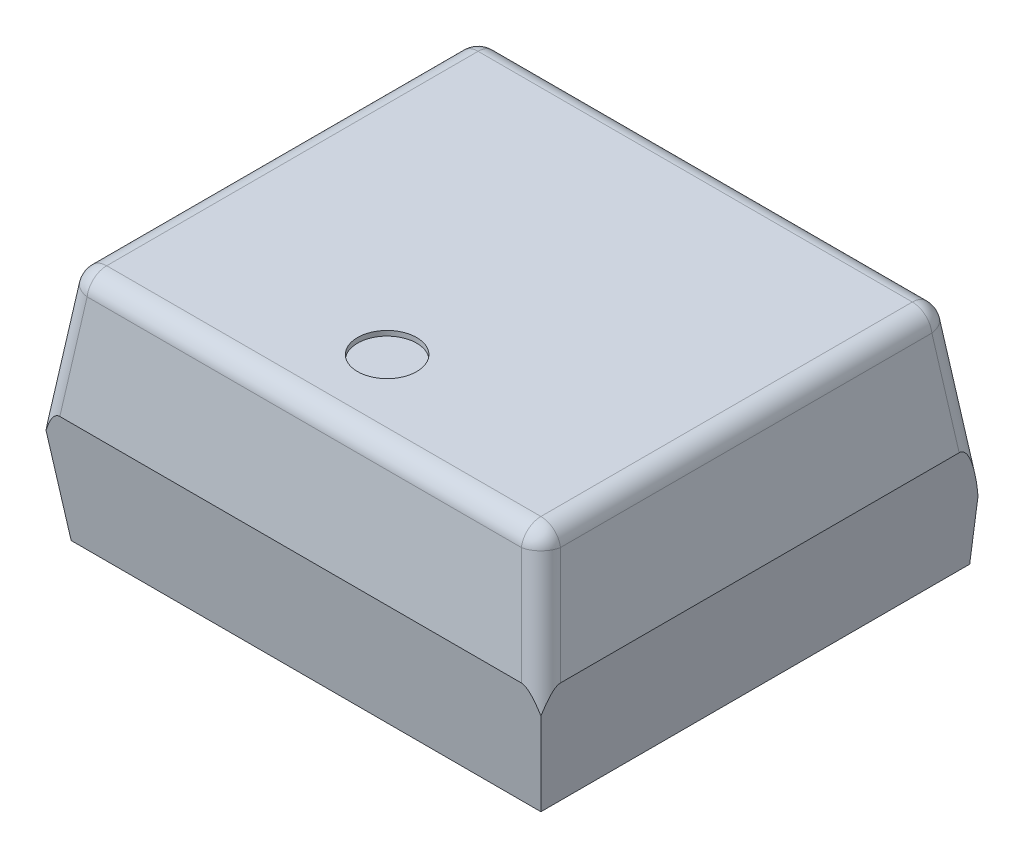
ISO-10303-21;
HEADER;
FILE_DESCRIPTION(('STEP AP214'),'2;1');
FILE_NAME('part.step','',(''),(''),'','','');
FILE_SCHEMA(('AUTOMOTIVE_DESIGN { 1 0 10303 214 1 1 1 1 }'));
ENDSEC;
DATA;
#1=APPLICATION_CONTEXT('core data for automotive mechanical design processes');
#2=APPLICATION_PROTOCOL_DEFINITION('international standard','automotive_design',2000,#1);
#3=PRODUCT_CONTEXT('',#1,'mechanical');
#4=PRODUCT('Part','Part','',(#3));
#5=PRODUCT_RELATED_PRODUCT_CATEGORY('part','',(#4));
#6=PRODUCT_DEFINITION_FORMATION('','',#4);
#7=PRODUCT_DEFINITION_CONTEXT('part definition',#1,'design');
#8=PRODUCT_DEFINITION('design','',#6,#7);
#9=PRODUCT_DEFINITION_SHAPE('','',#8);
#10=(LENGTH_UNIT() NAMED_UNIT(*) SI_UNIT(.MILLI.,.METRE.));
#11=(NAMED_UNIT(*) PLANE_ANGLE_UNIT() SI_UNIT($,.RADIAN.));
#12=(NAMED_UNIT(*) SI_UNIT($,.STERADIAN.) SOLID_ANGLE_UNIT());
#13=UNCERTAINTY_MEASURE_WITH_UNIT(LENGTH_MEASURE(1.E-05),#10,'distance_accuracy_value','');
#14=(GEOMETRIC_REPRESENTATION_CONTEXT(3) GLOBAL_UNCERTAINTY_ASSIGNED_CONTEXT((#13)) GLOBAL_UNIT_ASSIGNED_CONTEXT((#10,
#11,#12)) REPRESENTATION_CONTEXT('',''));
#15=CARTESIAN_POINT('',(0.,0.,0.));
#16=DIRECTION('',(0.,0.,1.));
#17=DIRECTION('',(1.,0.,0.));
#18=AXIS2_PLACEMENT_3D('',#15,#16,#17);
#19=CARTESIAN_POINT('',(-4.406529143216,2.051,0.));
#20=DIRECTION('',(0.,0.,1.));
#21=DIRECTION('',(-0.659345815100019,0.751839807479021,0.));
#22=AXIS2_PLACEMENT_3D('',#19,#20,#21);
#23=CYLINDRICAL_SURFACE('',#22,0.4);
#24=CARTESIAN_POINT('',(-4.406529143216,2.051,-3.834029143216));
#25=DIRECTION('',(0.,0.,1.));
#26=DIRECTION('',(0.,1.,0.));
#27=AXIS2_PLACEMENT_3D('',#24,#25,#26);
#28=CIRCLE('',#27,0.4);
#29=CARTESIAN_POINT('',(-4.406529143216,2.451,-3.834029143216));
#30=VERTEX_POINT('',#29);
#31=CARTESIAN_POINT('',(-4.803107087766,2.103210476888,-3.834029143216));
#32=VERTEX_POINT('',#31);
#33=EDGE_CURVE('E11',#30,#32,#28,.T.);
#34=ORIENTED_EDGE('',*,*,#33,.T.);
#35=DIRECTION('',(0.,0.,1.));
#36=VECTOR('',#35,1.);
#37=CARTESIAN_POINT('',(-4.803107087766,2.103210476888,0.));
#38=LINE('',#37,#36);
#39=CARTESIAN_POINT('',(-4.803107087766,2.103210476888,3.704029143216));
#40=VERTEX_POINT('',#39);
#41=EDGE_CURVE('E28',#32,#40,#38,.T.);
#42=ORIENTED_EDGE('',*,*,#41,.T.);
#43=CARTESIAN_POINT('',(-4.406529143216,2.051,3.704029143216));
#44=DIRECTION('',(0.,0.,-1.));
#45=DIRECTION('',(-0.99144486137382,0.130526192219976,0.));
#46=AXIS2_PLACEMENT_3D('',#43,#44,#45);
#47=CIRCLE('',#46,0.4);
#48=CARTESIAN_POINT('',(-4.406529143216,2.451,3.704029143216));
#49=VERTEX_POINT('',#48);
#50=EDGE_CURVE('E222',#40,#49,#47,.T.);
#51=ORIENTED_EDGE('',*,*,#50,.T.);
#52=DIRECTION('',(0.,0.,-1.));
#53=VECTOR('',#52,1.);
#54=CARTESIAN_POINT('',(-4.406529143216,2.451,0.));
#55=LINE('',#54,#53);
#56=EDGE_CURVE('E218',#49,#30,#55,.T.);
#57=ORIENTED_EDGE('',*,*,#56,.T.);
#58=EDGE_LOOP('',(#34,#42,#51,#57));
#59=FACE_BOUND('',#58,.T.);
#60=ADVANCED_FACE('F17',(#59),#23,.T.);
#61=CARTESIAN_POINT('',(-5.08,2.051,-3.834029143216));
#62=DIRECTION('',(-1.,0.,0.));
#63=DIRECTION('',(0.,0.751839807479021,-0.659345815100019));
#64=AXIS2_PLACEMENT_3D('',#61,#62,#63);
#65=CYLINDRICAL_SURFACE('',#64,0.4);
#66=CARTESIAN_POINT('',(4.406529143216,2.051,-3.834029143216));
#67=DIRECTION('',(-1.,0.,0.));
#68=DIRECTION('',(0.,1.,0.));
#69=AXIS2_PLACEMENT_3D('',#66,#67,#68);
#70=CIRCLE('',#69,0.4);
#71=CARTESIAN_POINT('',(4.406529143216,2.451,-3.834029143216));
#72=VERTEX_POINT('',#71);
#73=CARTESIAN_POINT('',(4.406529143216,2.103210476888,-4.230607087766));
#74=VERTEX_POINT('',#73);
#75=EDGE_CURVE('E223',#72,#74,#70,.T.);
#76=ORIENTED_EDGE('',*,*,#75,.T.);
#77=DIRECTION('',(-1.,0.,0.));
#78=VECTOR('',#77,1.);
#79=CARTESIAN_POINT('',(-5.08,2.103210476888,-4.230607087766));
#80=LINE('',#79,#78);
#81=CARTESIAN_POINT('',(-4.406529143216,2.103210476888,-4.230607087766));
#82=VERTEX_POINT('',#81);
#83=EDGE_CURVE('E252',#74,#82,#80,.T.);
#84=ORIENTED_EDGE('',*,*,#83,.T.);
#85=CARTESIAN_POINT('',(-4.406529143216,2.051,-3.834029143216));
#86=DIRECTION('',(1.,0.,0.));
#87=DIRECTION('',(0.,0.130526192219976,-0.99144486137382));
#88=AXIS2_PLACEMENT_3D('',#85,#86,#87);
#89=CIRCLE('',#88,0.4);
#90=EDGE_CURVE('E365',#82,#30,#89,.T.);
#91=ORIENTED_EDGE('',*,*,#90,.T.);
#92=DIRECTION('',(1.,0.,0.));
#93=VECTOR('',#92,1.);
#94=CARTESIAN_POINT('',(-5.08,2.451,-3.834029143216));
#95=LINE('',#94,#93);
#96=EDGE_CURVE('E300',#30,#72,#95,.T.);
#97=ORIENTED_EDGE('',*,*,#96,.T.);
#98=EDGE_LOOP('',(#76,#84,#91,#97));
#99=FACE_BOUND('',#98,.T.);
#100=ADVANCED_FACE('F489',(#99),#65,.T.);
#101=CARTESIAN_POINT('',(-4.406529143216,2.051,-3.834029143216));
#102=DIRECTION('',(0.,0.,1.));
#103=DIRECTION('',(1.,0.,0.));
#104=AXIS2_PLACEMENT_3D('',#101,#102,#103);
#105=SPHERICAL_SURFACE('',#104,0.4);
#106=ORIENTED_EDGE('',*,*,#90,.F.);
#107=CARTESIAN_POINT('',(-4.406529143216,2.051,-3.834029143216));
#108=DIRECTION('',(0.1294283079954,0.983105602760403,0.1294283079954));
#109=DIRECTION('',(-0.695160638334369,0.183039268522097,-0.695160638334369));
#110=AXIS2_PLACEMENT_3D('',#107,#108,#109);
#111=CIRCLE('',#110,0.4);
#112=EDGE_CURVE('E42',#82,#32,#111,.T.);
#113=ORIENTED_EDGE('',*,*,#112,.T.);
#114=ORIENTED_EDGE('',*,*,#33,.F.);
#115=EDGE_LOOP('',(#106,#113,#114));
#116=FACE_BOUND('',#115,.T.);
#117=ADVANCED_FACE('F495',(#116),#105,.T.);
#118=CARTESIAN_POINT('',(4.406529143216,2.051,0.));
#119=DIRECTION('',(0.,0.,-1.));
#120=DIRECTION('',(0.659345815100019,0.751839807479021,0.));
#121=AXIS2_PLACEMENT_3D('',#118,#119,#120);
#122=CYLINDRICAL_SURFACE('',#121,0.4);
#123=CARTESIAN_POINT('',(4.406529143216,2.051,3.704029143216));
#124=DIRECTION('',(0.,0.,-1.));
#125=DIRECTION('',(0.,1.,0.));
#126=AXIS2_PLACEMENT_3D('',#123,#124,#125);
#127=CIRCLE('',#126,0.4);
#128=CARTESIAN_POINT('',(4.406529143216,2.451,3.704029143216));
#129=VERTEX_POINT('',#128);
#130=CARTESIAN_POINT('',(4.803107087766,2.103210476888,3.704029143216));
#131=VERTEX_POINT('',#130);
#132=EDGE_CURVE('E301',#129,#131,#127,.T.);
#133=ORIENTED_EDGE('',*,*,#132,.T.);
#134=DIRECTION('',(0.,0.,-1.));
#135=VECTOR('',#134,1.);
#136=CARTESIAN_POINT('',(4.803107087766,2.103210476888,0.));
#137=LINE('',#136,#135);
#138=CARTESIAN_POINT('',(4.803107087766,2.103210476888,-3.834029143216));
#139=VERTEX_POINT('',#138);
#140=EDGE_CURVE('E274',#131,#139,#137,.T.);
#141=ORIENTED_EDGE('',*,*,#140,.T.);
#142=CARTESIAN_POINT('',(4.406529143216,2.051,-3.834029143216));
#143=DIRECTION('',(0.,0.,1.));
#144=DIRECTION('',(0.99144486137382,0.130526192219976,0.));
#145=AXIS2_PLACEMENT_3D('',#142,#143,#144);
#146=CIRCLE('',#145,0.4);
#147=EDGE_CURVE('E271',#139,#72,#146,.T.);
#148=ORIENTED_EDGE('',*,*,#147,.T.);
#149=DIRECTION('',(0.,0.,1.));
#150=VECTOR('',#149,1.);
#151=CARTESIAN_POINT('',(4.406529143216,2.451,0.));
#152=LINE('',#151,#150);
#153=EDGE_CURVE('E275',#72,#129,#152,.T.);
#154=ORIENTED_EDGE('',*,*,#153,.T.);
#155=EDGE_LOOP('',(#133,#141,#148,#154));
#156=FACE_BOUND('',#155,.T.);
#157=ADVANCED_FACE('F523',(#156),#122,.T.);
#158=CARTESIAN_POINT('',(4.406529143216,2.051,-3.834029143216));
#159=DIRECTION('',(0.,0.,1.));
#160=DIRECTION('',(1.,0.,0.));
#161=AXIS2_PLACEMENT_3D('',#158,#159,#160);
#162=SPHERICAL_SURFACE('',#161,0.4);
#163=ORIENTED_EDGE('',*,*,#147,.F.);
#164=CARTESIAN_POINT('',(4.406529143216,2.051,-3.834029143216));
#165=DIRECTION('',(-0.1294283079954,0.983105602760403,0.1294283079954));
#166=DIRECTION('',(0.695160638334369,0.183039268522097,-0.695160638334369));
#167=AXIS2_PLACEMENT_3D('',#164,#165,#166);
#168=CIRCLE('',#167,0.4);
#169=EDGE_CURVE('E21',#139,#74,#168,.T.);
#170=ORIENTED_EDGE('',*,*,#169,.T.);
#171=ORIENTED_EDGE('',*,*,#75,.F.);
#172=EDGE_LOOP('',(#163,#170,#171));
#173=FACE_BOUND('',#172,.T.);
#174=ADVANCED_FACE('F504',(#173),#162,.T.);
#175=CARTESIAN_POINT('',(-5.08,2.051,3.704029143216));
#176=DIRECTION('',(1.,0.,0.));
#177=DIRECTION('',(0.,0.751839807479021,0.659345815100019));
#178=AXIS2_PLACEMENT_3D('',#175,#176,#177);
#179=CYLINDRICAL_SURFACE('',#178,0.4);
#180=CARTESIAN_POINT('',(-4.406529143216,2.051,3.704029143216));
#181=DIRECTION('',(1.,0.,0.));
#182=DIRECTION('',(0.,1.,0.));
#183=AXIS2_PLACEMENT_3D('',#180,#181,#182);
#184=CIRCLE('',#183,0.4);
#185=CARTESIAN_POINT('',(-4.406529143216,2.103210476888,4.100607087766));
#186=VERTEX_POINT('',#185);
#187=EDGE_CURVE('E283',#49,#186,#184,.T.);
#188=ORIENTED_EDGE('',*,*,#187,.T.);
#189=DIRECTION('',(1.,0.,0.));
#190=VECTOR('',#189,1.);
#191=CARTESIAN_POINT('',(-5.08,2.103210476888,4.100607087766));
#192=LINE('',#191,#190);
#193=CARTESIAN_POINT('',(4.406529143216,2.103210476888,4.100607087766));
#194=VERTEX_POINT('',#193);
#195=EDGE_CURVE('E279',#186,#194,#192,.T.);
#196=ORIENTED_EDGE('',*,*,#195,.T.);
#197=CARTESIAN_POINT('',(4.406529143216,2.051,3.704029143216));
#198=DIRECTION('',(-1.,0.,0.));
#199=DIRECTION('',(0.,0.130526192219976,0.99144486137382));
#200=AXIS2_PLACEMENT_3D('',#197,#198,#199);
#201=CIRCLE('',#200,0.4);
#202=EDGE_CURVE('E206',#194,#129,#201,.T.);
#203=ORIENTED_EDGE('',*,*,#202,.T.);
#204=DIRECTION('',(-1.,0.,0.));
#205=VECTOR('',#204,1.);
#206=CARTESIAN_POINT('',(-5.08,2.451,3.704029143216));
#207=LINE('',#206,#205);
#208=EDGE_CURVE('E202',#129,#49,#207,.T.);
#209=ORIENTED_EDGE('',*,*,#208,.T.);
#210=EDGE_LOOP('',(#188,#196,#203,#209));
#211=FACE_BOUND('',#210,.T.);
#212=ADVANCED_FACE('F500',(#211),#179,.T.);
#213=CARTESIAN_POINT('',(4.406529143216,2.051,3.704029143216));
#214=DIRECTION('',(0.,0.,1.));
#215=DIRECTION('',(1.,0.,0.));
#216=AXIS2_PLACEMENT_3D('',#213,#214,#215);
#217=SPHERICAL_SURFACE('',#216,0.4);
#218=ORIENTED_EDGE('',*,*,#202,.F.);
#219=CARTESIAN_POINT('',(4.406529143216,2.051,3.704029143216));
#220=DIRECTION('',(-0.1294283079954,0.983105602760403,-0.1294283079954));
#221=DIRECTION('',(0.695160638334369,0.183039268522097,0.695160638334369));
#222=AXIS2_PLACEMENT_3D('',#219,#220,#221);
#223=CIRCLE('',#222,0.4);
#224=EDGE_CURVE('E207',#194,#131,#223,.T.);
#225=ORIENTED_EDGE('',*,*,#224,.T.);
#226=ORIENTED_EDGE('',*,*,#132,.F.);
#227=EDGE_LOOP('',(#218,#225,#226));
#228=FACE_BOUND('',#227,.T.);
#229=ADVANCED_FACE('F503',(#228),#217,.T.);
#230=CARTESIAN_POINT('',(-4.406529143216,2.051,3.704029143216));
#231=DIRECTION('',(0.,0.,1.));
#232=DIRECTION('',(1.,0.,0.));
#233=AXIS2_PLACEMENT_3D('',#230,#231,#232);
#234=SPHERICAL_SURFACE('',#233,0.4);
#235=ORIENTED_EDGE('',*,*,#50,.F.);
#236=CARTESIAN_POINT('',(-4.406529143216,2.051,3.704029143216));
#237=DIRECTION('',(0.1294283079954,0.983105602760403,-0.1294283079954));
#238=DIRECTION('',(-0.695160638334369,0.183039268522097,0.695160638334369));
#239=AXIS2_PLACEMENT_3D('',#236,#237,#238);
#240=CIRCLE('',#239,0.4);
#241=EDGE_CURVE('E305',#40,#186,#240,.T.);
#242=ORIENTED_EDGE('',*,*,#241,.T.);
#243=ORIENTED_EDGE('',*,*,#187,.F.);
#244=EDGE_LOOP('',(#235,#242,#243));
#245=FACE_BOUND('',#244,.T.);
#246=ADVANCED_FACE('F540',(#245),#234,.T.);
#247=CARTESIAN_POINT('',(4.604966835507,0.543716082659,-4.032466835507));
#248=DIRECTION('',(0.1294283079954,-0.983105602760403,-0.1294283079954));
#249=DIRECTION('',(0.695160638334369,0.183039268522097,-0.695160638334369));
#250=AXIS2_PLACEMENT_3D('',#247,#248,#249);
#251=CYLINDRICAL_SURFACE('',#250,0.4);
#252=ORIENTED_EDGE('',*,*,#169,.F.);
#253=DIRECTION('',(0.129428307996031,-0.983105602760237,-0.129428307996031));
#254=VECTOR('',#253,1.);
#255=CARTESIAN_POINT('',(5.001544780057,0.595926559547,-4.032466835507));
#256=LINE('',#255,#254);
#257=CARTESIAN_POINT('',(5.08,0.,-4.11092205545));
#258=VERTEX_POINT('',#257);
#259=EDGE_CURVE('E235',#139,#258,#256,.T.);
#260=ORIENTED_EDGE('',*,*,#259,.T.);
#261=CARTESIAN_POINT('',(4.878274207884,-1.532259515108,-4.305774207884));
#262=DIRECTION('',(-0.991444861373783,0.130526192220259,0.));
#263=DIRECTION('',(0.129350545319965,0.982514936595735,0.133913538492964));
#264=AXIS2_PLACEMENT_3D('',#261,#262,#263);
#265=ELLIPSE('',#264,1.558590970091,0.4);
#266=CARTESIAN_POINT('',(4.935167966594,-1.100108513396,-4.637835972612));
#267=VERTEX_POINT('',#266);
#268=EDGE_CURVE('E231',#258,#267,#265,.T.);
#269=ORIENTED_EDGE('',*,*,#268,.T.);
#270=CARTESIAN_POINT('',(5.210335972612,-4.054519030216,-4.637835972612));
#271=DIRECTION('',(0.,0.,1.));
#272=DIRECTION('',(-0.130526192219976,0.99144486137382,0.));
#273=AXIS2_PLACEMENT_3D('',#270,#271,#272);
#274=ELLIPSE('',#273,3.09051401656,0.4);
#275=CARTESIAN_POINT('',(4.813758028062,-0.99,-4.637835972612));
#276=VERTEX_POINT('',#275);
#277=EDGE_CURVE('E236',#267,#276,#274,.T.);
#278=ORIENTED_EDGE('',*,*,#277,.T.);
#279=DIRECTION('',(-0.129428307996031,0.983105602760237,0.129428307996031));
#280=VECTOR('',#279,1.);
#281=CARTESIAN_POINT('',(4.604966835507,0.595926559547,-4.429044780057));
#282=LINE('',#281,#280);
#283=EDGE_CURVE('E245',#276,#74,#282,.T.);
#284=ORIENTED_EDGE('',*,*,#283,.T.);
#285=EDGE_LOOP('',(#252,#260,#269,#278,#284));
#286=FACE_BOUND('',#285,.T.);
#287=ADVANCED_FACE('F499',(#286),#251,.T.);
#288=CARTESIAN_POINT('',(5.08,0.,-4.5075));
#289=DIRECTION('',(0.99144486137382,0.130526192219976,0.));
#290=DIRECTION('',(0.,0.,-1.));
#291=AXIS2_PLACEMENT_3D('',#288,#289,#290);
#292=PLANE('',#291);
#293=ORIENTED_EDGE('',*,*,#140,.F.);
#294=DIRECTION('',(-0.129428307996031,0.983105602760237,-0.129428307996031));
#295=VECTOR('',#294,1.);
#296=CARTESIAN_POINT('',(4.927125410957,1.161197788458,3.828047466407));
#297=LINE('',#296,#295);
#298=CARTESIAN_POINT('',(5.08,0.,3.98092205545));
#299=VERTEX_POINT('',#298);
#300=EDGE_CURVE('E266',#299,#131,#297,.T.);
#301=ORIENTED_EDGE('',*,*,#300,.F.);
#302=DIRECTION('',(0.,0.,-1.));
#303=VECTOR('',#302,1.);
#304=CARTESIAN_POINT('',(5.08,0.,-4.5075));
#305=LINE('',#304,#303);
#306=EDGE_CURVE('E321',#299,#258,#305,.T.);
#307=ORIENTED_EDGE('',*,*,#306,.T.);
#308=ORIENTED_EDGE('',*,*,#259,.F.);
#309=EDGE_LOOP('',(#293,#301,#307,#308));
#310=FACE_BOUND('',#309,.T.);
#311=ADVANCED_FACE('F535',(#310),#292,.T.);
#312=CARTESIAN_POINT('',(4.530547466407,1.10898731157,3.828047466407));
#313=DIRECTION('',(0.1294283079954,-0.983105602760403,0.1294283079954));
#314=DIRECTION('',(0.695160638334369,0.183039268522097,0.695160638334369));
#315=AXIS2_PLACEMENT_3D('',#312,#313,#314);
#316=CYLINDRICAL_SURFACE('',#315,0.4);
#317=ORIENTED_EDGE('',*,*,#224,.F.);
#318=DIRECTION('',(0.129428307996031,-0.983105602760237,0.129428307996031));
#319=VECTOR('',#318,1.);
#320=CARTESIAN_POINT('',(4.530547466407,1.161197788458,4.224625410957));
#321=LINE('',#320,#319);
#322=CARTESIAN_POINT('',(4.68342205545,0.,4.3775));
#323=VERTEX_POINT('',#322);
#324=EDGE_CURVE('E264',#194,#323,#321,.T.);
#325=ORIENTED_EDGE('',*,*,#324,.T.);
#326=CARTESIAN_POINT('',(4.878274207884,-1.532259515108,4.175774207884));
#327=DIRECTION('',(0.,0.130526192220259,-0.991444861373783));
#328=DIRECTION('',(-0.133913538492964,0.982514936595735,0.129350545319965));
#329=AXIS2_PLACEMENT_3D('',#326,#327,#328);
#330=ELLIPSE('',#329,1.558590970091,0.4);
#331=CARTESIAN_POINT('',(5.022125850922,-0.439597805877,4.319625850922));
#332=VERTEX_POINT('',#331);
#333=EDGE_CURVE('E260',#323,#332,#330,.T.);
#334=ORIENTED_EDGE('',*,*,#333,.T.);
#335=CARTESIAN_POINT('',(4.878274207884,-1.532259515108,4.175774207884));
#336=DIRECTION('',(-0.991444861373783,0.130526192220259,0.));
#337=DIRECTION('',(0.129350545319965,0.982514936595735,-0.133913538492964));
#338=AXIS2_PLACEMENT_3D('',#335,#336,#337);
#339=ELLIPSE('',#338,1.558590970091,0.4);
#340=EDGE_CURVE('E265',#332,#299,#339,.T.);
#341=ORIENTED_EDGE('',*,*,#340,.T.);
#342=ORIENTED_EDGE('',*,*,#300,.T.);
#343=EDGE_LOOP('',(#317,#325,#334,#341,#342));
#344=FACE_BOUND('',#343,.T.);
#345=ADVANCED_FACE('F538',(#344),#316,.T.);
#346=CARTESIAN_POINT('',(-5.08,0.,4.3775));
#347=DIRECTION('',(0.,0.130526192219976,0.99144486137382));
#348=DIRECTION('',(1.,0.,0.));
#349=AXIS2_PLACEMENT_3D('',#346,#347,#348);
#350=PLANE('',#349);
#351=ORIENTED_EDGE('',*,*,#195,.F.);
#352=DIRECTION('',(0.129428307996031,0.983105602760237,-0.129428307996031));
#353=VECTOR('',#352,1.);
#354=CARTESIAN_POINT('',(-4.615646035913,0.514809979147,4.309723980462));
#355=LINE('',#354,#353);
#356=CARTESIAN_POINT('',(-4.68342205545,0.,4.3775));
#357=VERTEX_POINT('',#356);
#358=EDGE_CURVE('E226',#357,#186,#355,.T.);
#359=ORIENTED_EDGE('',*,*,#358,.F.);
#360=DIRECTION('',(1.,0.,0.));
#361=VECTOR('',#360,1.);
#362=CARTESIAN_POINT('',(-5.08,0.,4.3775));
#363=LINE('',#362,#361);
#364=EDGE_CURVE('E270',#357,#323,#363,.T.);
#365=ORIENTED_EDGE('',*,*,#364,.T.);
#366=ORIENTED_EDGE('',*,*,#324,.F.);
#367=EDGE_LOOP('',(#351,#359,#365,#366));
#368=FACE_BOUND('',#367,.T.);
#369=ADVANCED_FACE('F510',(#368),#350,.T.);
#370=CARTESIAN_POINT('',(-5.08,2.451,4.5075));
#371=DIRECTION('',(0.,1.,0.));
#372=DIRECTION('',(1.,0.,0.));
#373=AXIS2_PLACEMENT_3D('',#370,#371,#372);
#374=PLANE('',#373);
#375=ORIENTED_EDGE('',*,*,#56,.F.);
#376=ORIENTED_EDGE('',*,*,#208,.F.);
#377=ORIENTED_EDGE('',*,*,#153,.F.);
#378=ORIENTED_EDGE('',*,*,#96,.F.);
#379=EDGE_LOOP('',(#375,#376,#377,#378));
#380=FACE_BOUND('',#379,.T.);
#381=CARTESIAN_POINT('',(0.,2.451,2.41892237669));
#382=DIRECTION('',(0.,-1.,0.));
#383=DIRECTION('',(-1.,0.,0.));
#384=AXIS2_PLACEMENT_3D('',#381,#382,#383);
#385=CIRCLE('',#384,0.6);
#386=CARTESIAN_POINT('',(0.6,2.451,2.41892237669));
#387=VERTEX_POINT('',#386);
#388=EDGE_CURVE('E216',#387,#387,#385,.T.);
#389=ORIENTED_EDGE('',*,*,#388,.T.);
#390=EDGE_LOOP('',(#389));
#391=FACE_BOUND('',#390,.T.);
#392=ADVANCED_FACE('F506',(#380,#391),#374,.T.);
#393=CARTESIAN_POINT('',(-4.690065405013,-0.102671726651,-4.117565405013));
#394=DIRECTION('',(-0.1294283079954,-0.983105602760403,-0.1294283079954));
#395=DIRECTION('',(-0.695160638334369,0.183039268522097,-0.695160638334369));
#396=AXIS2_PLACEMENT_3D('',#393,#394,#395);
#397=CYLINDRICAL_SURFACE('',#396,0.4);
#398=ORIENTED_EDGE('',*,*,#112,.F.);
#399=DIRECTION('',(-0.129428307996031,-0.983105602760237,-0.129428307996031));
#400=VECTOR('',#399,1.);
#401=CARTESIAN_POINT('',(-4.690065405013,-0.05046124976346,-4.514143349563));
#402=LINE('',#401,#400);
#403=CARTESIAN_POINT('',(-4.813758028062,-0.99,-4.637835972612));
#404=VERTEX_POINT('',#403);
#405=EDGE_CURVE('E212',#82,#404,#402,.T.);
#406=ORIENTED_EDGE('',*,*,#405,.T.);
#407=CARTESIAN_POINT('',(-5.210335972612,-4.054519030216,-4.637835972612));
#408=DIRECTION('',(0.,0.,1.));
#409=DIRECTION('',(0.130526192219976,0.99144486137382,0.));
#410=AXIS2_PLACEMENT_3D('',#407,#408,#409);
#411=ELLIPSE('',#410,3.09051401656,0.4);
#412=CARTESIAN_POINT('',(-4.935167966594,-1.100108513396,-4.637835972612));
#413=VERTEX_POINT('',#412);
#414=EDGE_CURVE('E217',#404,#413,#411,.T.);
#415=ORIENTED_EDGE('',*,*,#414,.T.);
#416=CARTESIAN_POINT('',(-4.878274207884,-1.532259515108,-4.305774207884));
#417=DIRECTION('',(0.991444861373783,0.130526192220259,0.));
#418=DIRECTION('',(-0.129350545319965,0.982514936595735,0.133913538492964));
#419=AXIS2_PLACEMENT_3D('',#416,#417,#418);
#420=ELLIPSE('',#419,1.558590970091,0.4);
#421=CARTESIAN_POINT('',(-5.08,0.,-4.11092205545));
#422=VERTEX_POINT('',#421);
#423=EDGE_CURVE('E325',#413,#422,#420,.T.);
#424=ORIENTED_EDGE('',*,*,#423,.T.);
#425=DIRECTION('',(0.129428307996031,0.983105602760237,0.129428307996031));
#426=VECTOR('',#425,1.);
#427=CARTESIAN_POINT('',(-5.086643349563,-0.05046124976346,-4.117565405013));
#428=LINE('',#427,#426);
#429=EDGE_CURVE('E329',#422,#32,#428,.T.);
#430=ORIENTED_EDGE('',*,*,#429,.T.);
#431=EDGE_LOOP('',(#398,#406,#415,#424,#430));
#432=FACE_BOUND('',#431,.T.);
#433=ADVANCED_FACE('F509',(#432),#397,.T.);
#434=CARTESIAN_POINT('',(-5.08,0.,-4.5075));
#435=DIRECTION('',(-0.99144486137382,0.130526192219976,0.));
#436=DIRECTION('',(0.,0.,1.));
#437=AXIS2_PLACEMENT_3D('',#434,#435,#436);
#438=PLANE('',#437);
#439=ORIENTED_EDGE('',*,*,#41,.F.);
#440=ORIENTED_EDGE('',*,*,#429,.F.);
#441=DIRECTION('',(0.,0.,1.));
#442=VECTOR('',#441,1.);
#443=CARTESIAN_POINT('',(-5.08,0.,-4.5075));
#444=LINE('',#443,#442);
#445=CARTESIAN_POINT('',(-5.08,0.,3.98092205545));
#446=VERTEX_POINT('',#445);
#447=EDGE_CURVE('E336',#422,#446,#444,.T.);
#448=ORIENTED_EDGE('',*,*,#447,.T.);
#449=DIRECTION('',(-0.129428307996031,-0.983105602760237,0.129428307996031));
#450=VECTOR('',#449,1.);
#451=CARTESIAN_POINT('',(-5.012223980462,0.514809979147,3.913146035913));
#452=LINE('',#451,#450);
#453=EDGE_CURVE('E164',#40,#446,#452,.T.);
#454=ORIENTED_EDGE('',*,*,#453,.F.);
#455=EDGE_LOOP('',(#439,#440,#448,#454));
#456=FACE_BOUND('',#455,.T.);
#457=ADVANCED_FACE('F514',(#456),#438,.T.);
#458=CARTESIAN_POINT('',(-5.08,0.,-4.5075));
#459=DIRECTION('',(-0.99144486137382,-0.130526192219976,0.));
#460=DIRECTION('',(-0.130526192219976,0.99144486137382,0.));
#461=AXIS2_PLACEMENT_3D('',#458,#459,#460);
#462=PLANE('',#461);
#463=ORIENTED_EDGE('',*,*,#423,.F.);
#464=DIRECTION('',(0.130526192219976,-0.99144486137382,0.));
#465=VECTOR('',#464,1.);
#466=CARTESIAN_POINT('',(-4.924963570759,-1.177618595033,-4.637835972612));
#467=LINE('',#466,#465);
#468=CARTESIAN_POINT('',(-4.766811873489,-2.3789,-4.637835972612));
#469=VERTEX_POINT('',#468);
#470=EDGE_CURVE('E169',#413,#469,#467,.T.);
#471=ORIENTED_EDGE('',*,*,#470,.T.);
#472=DIRECTION('',(0.,0.,1.));
#473=VECTOR('',#472,1.);
#474=CARTESIAN_POINT('',(-4.766811873489,-2.3789,-2.131119521456));
#475=LINE('',#474,#473);
#476=CARTESIAN_POINT('',(-4.766811873489,-2.3789,4.064311873489));
#477=VERTEX_POINT('',#476);
#478=EDGE_CURVE('E163',#469,#477,#475,.T.);
#479=ORIENTED_EDGE('',*,*,#478,.T.);
#480=DIRECTION('',(-0.129428307996031,0.983105602760237,0.129428307996031));
#481=VECTOR('',#480,1.);
#482=CARTESIAN_POINT('',(-4.928983542501,-1.147083878137,4.226483542501));
#483=LINE('',#482,#481);
#484=CARTESIAN_POINT('',(-5.022125850922,-0.439597805877,4.319625850922));
#485=VERTEX_POINT('',#484);
#486=EDGE_CURVE('E153',#477,#485,#483,.T.);
#487=ORIENTED_EDGE('',*,*,#486,.T.);
#488=CARTESIAN_POINT('',(-4.878274207884,-1.532259515108,4.175774207884));
#489=DIRECTION('',(0.991444861373783,0.130526192220259,0.));
#490=DIRECTION('',(-0.129350545319965,0.982514936595735,-0.133913538492964));
#491=AXIS2_PLACEMENT_3D('',#488,#489,#490);
#492=ELLIPSE('',#491,1.558590970091,0.4);
#493=EDGE_CURVE('E145',#446,#485,#492,.T.);
#494=ORIENTED_EDGE('',*,*,#493,.F.);
#495=ORIENTED_EDGE('',*,*,#447,.F.);
#496=EDGE_LOOP('',(#463,#471,#479,#487,#494,#495));
#497=FACE_BOUND('',#496,.T.);
#498=ADVANCED_FACE('F167',(#497),#462,.T.);
#499=CARTESIAN_POINT('',(-4.615646035913,0.462599502259,3.913146035913));
#500=DIRECTION('',(-0.1294283079954,-0.983105602760403,0.1294283079954));
#501=DIRECTION('',(-0.695160638334369,0.183039268522097,0.695160638334369));
#502=AXIS2_PLACEMENT_3D('',#499,#500,#501);
#503=CYLINDRICAL_SURFACE('',#502,0.4);
#504=ORIENTED_EDGE('',*,*,#241,.F.);
#505=ORIENTED_EDGE('',*,*,#453,.T.);
#506=ORIENTED_EDGE('',*,*,#493,.T.);
#507=CARTESIAN_POINT('',(-4.878274207884,-1.532259515108,4.175774207884));
#508=DIRECTION('',(0.,0.130526192220259,-0.991444861373783));
#509=DIRECTION('',(0.133913538492964,0.982514936595735,0.129350545319965));
#510=AXIS2_PLACEMENT_3D('',#507,#508,#509);
#511=ELLIPSE('',#510,1.558590970091,0.4);
#512=EDGE_CURVE('E160',#485,#357,#511,.T.);
#513=ORIENTED_EDGE('',*,*,#512,.T.);
#514=ORIENTED_EDGE('',*,*,#358,.T.);
#515=EDGE_LOOP('',(#504,#505,#506,#513,#514));
#516=FACE_BOUND('',#515,.T.);
#517=ADVANCED_FACE('F546',(#516),#503,.T.);
#518=CARTESIAN_POINT('',(5.08,0.,-4.5075));
#519=DIRECTION('',(0.99144486137382,-0.130526192219976,0.));
#520=DIRECTION('',(0.,0.,-1.));
#521=AXIS2_PLACEMENT_3D('',#518,#519,#520);
#522=PLANE('',#521);
#523=ORIENTED_EDGE('',*,*,#340,.F.);
#524=DIRECTION('',(0.129428307996031,0.983105602760237,0.129428307996031));
#525=VECTOR('',#524,1.);
#526=CARTESIAN_POINT('',(4.909802860988,-1.292775618622,4.207302860988));
#527=LINE('',#526,#525);
#528=CARTESIAN_POINT('',(4.766811873489,-2.3789,4.064311873489));
#529=VERTEX_POINT('',#528);
#530=EDGE_CURVE('E182',#529,#332,#527,.T.);
#531=ORIENTED_EDGE('',*,*,#530,.F.);
#532=DIRECTION('',(0.,0.,-1.));
#533=VECTOR('',#532,1.);
#534=CARTESIAN_POINT('',(4.766811873489,-2.3789,-2.131119521456));
#535=LINE('',#534,#533);
#536=CARTESIAN_POINT('',(4.766811873489,-2.3789,-4.637835972612));
#537=VERTEX_POINT('',#536);
#538=EDGE_CURVE('E179',#529,#537,#535,.T.);
#539=ORIENTED_EDGE('',*,*,#538,.T.);
#540=DIRECTION('',(0.130526192219976,0.99144486137382,0.));
#541=VECTOR('',#540,1.);
#542=CARTESIAN_POINT('',(4.840635714819,-1.818152253607,-4.637835972612));
#543=LINE('',#542,#541);
#544=EDGE_CURVE('E181',#537,#267,#543,.T.);
#545=ORIENTED_EDGE('',*,*,#544,.T.);
#546=ORIENTED_EDGE('',*,*,#268,.F.);
#547=ORIENTED_EDGE('',*,*,#306,.F.);
#548=EDGE_LOOP('',(#523,#531,#539,#545,#546,#547));
#549=FACE_BOUND('',#548,.T.);
#550=ADVANCED_FACE('F518',(#549),#522,.T.);
#551=CARTESIAN_POINT('',(-5.08,0.,4.3775));
#552=DIRECTION('',(0.,-0.130526192219976,0.99144486137382));
#553=DIRECTION('',(-1.,0.,0.));
#554=AXIS2_PLACEMENT_3D('',#551,#552,#553);
#555=PLANE('',#554);
#556=ORIENTED_EDGE('',*,*,#512,.F.);
#557=ORIENTED_EDGE('',*,*,#486,.F.);
#558=DIRECTION('',(1.,0.,0.));
#559=VECTOR('',#558,1.);
#560=CARTESIAN_POINT('',(-2.065828829097,-2.3789,4.064311873489));
#561=LINE('',#560,#559);
#562=EDGE_CURVE('E158',#477,#529,#561,.T.);
#563=ORIENTED_EDGE('',*,*,#562,.T.);
#564=ORIENTED_EDGE('',*,*,#530,.T.);
#565=ORIENTED_EDGE('',*,*,#333,.F.);
#566=ORIENTED_EDGE('',*,*,#364,.F.);
#567=EDGE_LOOP('',(#556,#557,#563,#564,#565,#566));
#568=FACE_BOUND('',#567,.T.);
#569=ADVANCED_FACE('F155',(#568),#555,.T.);
#570=CARTESIAN_POINT('',(-5.08,0.,-4.5075));
#571=DIRECTION('',(0.,0.130526192219976,-0.99144486137382));
#572=DIRECTION('',(-1.,0.,0.));
#573=AXIS2_PLACEMENT_3D('',#570,#571,#572);
#574=PLANE('',#573);
#575=ORIENTED_EDGE('',*,*,#83,.F.);
#576=ORIENTED_EDGE('',*,*,#283,.F.);
#577=DIRECTION('',(-1.,0.,0.));
#578=VECTOR('',#577,1.);
#579=CARTESIAN_POINT('',(7.837924348314,-0.99,-4.637835972612));
#580=LINE('',#579,#578);
#581=CARTESIAN_POINT('',(3.11,-0.99,-4.637835972612));
#582=VERTEX_POINT('',#581);
#583=EDGE_CURVE('E190',#276,#582,#580,.T.);
#584=ORIENTED_EDGE('',*,*,#583,.T.);
#585=DIRECTION('',(0.,0.99144486137382,0.130526192219976));
#586=VECTOR('',#585,1.);
#587=CARTESIAN_POINT('',(3.11,-0.84048504976,-4.618151955986));
#588=LINE('',#587,#586);
#589=CARTESIAN_POINT('',(3.11,-0.9839,-4.637032892376));
#590=VERTEX_POINT('',#589);
#591=EDGE_CURVE('E200',#582,#590,#588,.T.);
#592=ORIENTED_EDGE('',*,*,#591,.T.);
#593=DIRECTION('',(-1.,0.,0.));
#594=VECTOR('',#593,1.);
#595=CARTESIAN_POINT('',(-1.650416623208,-0.9839,-4.637032892376));
#596=LINE('',#595,#594);
#597=CARTESIAN_POINT('',(-3.11,-0.9839,-4.637032892376));
#598=VERTEX_POINT('',#597);
#599=EDGE_CURVE('E196',#590,#598,#596,.T.);
#600=ORIENTED_EDGE('',*,*,#599,.T.);
#601=DIRECTION('',(0.,-0.99144486137382,-0.130526192219976));
#602=VECTOR('',#601,1.);
#603=CARTESIAN_POINT('',(-3.11,-1.28435971211,-4.6765891639));
#604=LINE('',#603,#602);
#605=CARTESIAN_POINT('',(-3.11,-0.99,-4.637835972612));
#606=VERTEX_POINT('',#605);
#607=EDGE_CURVE('E201',#598,#606,#604,.T.);
#608=ORIENTED_EDGE('',*,*,#607,.T.);
#609=DIRECTION('',(-1.,0.,0.));
#610=VECTOR('',#609,1.);
#611=CARTESIAN_POINT('',(7.837924348314,-0.99,-4.637835972612));
#612=LINE('',#611,#610);
#613=EDGE_CURVE('E211',#606,#404,#612,.T.);
#614=ORIENTED_EDGE('',*,*,#613,.T.);
#615=ORIENTED_EDGE('',*,*,#405,.F.);
#616=EDGE_LOOP('',(#575,#576,#584,#592,#600,#608,#614,#615));
#617=FACE_BOUND('',#616,.T.);
#618=ADVANCED_FACE('F416',(#617),#574,.T.);
#619=CARTESIAN_POINT('',(-4.949664027388,-2.3789,-4.637835972612));
#620=DIRECTION('',(0.,0.,1.));
#621=DIRECTION('',(1.,0.,0.));
#622=AXIS2_PLACEMENT_3D('',#619,#620,#621);
#623=PLANE('',#622);
#624=ORIENTED_EDGE('',*,*,#277,.F.);
#625=ORIENTED_EDGE('',*,*,#544,.F.);
#626=DIRECTION('',(1.,0.,0.));
#627=VECTOR('',#626,1.);
#628=CARTESIAN_POINT('',(-2.000660842792,-2.3789,-4.637835972612));
#629=LINE('',#628,#627);
#630=CARTESIAN_POINT('',(3.11,-2.3789,-4.637835972612));
#631=VERTEX_POINT('',#630);
#632=EDGE_CURVE('E240',#631,#537,#629,.T.);
#633=ORIENTED_EDGE('',*,*,#632,.F.);
#634=DIRECTION('',(0.,1.,0.));
#635=VECTOR('',#634,1.);
#636=CARTESIAN_POINT('',(3.11,-2.3789,-4.637835972612));
#637=LINE('',#636,#635);
#638=EDGE_CURVE('E230',#631,#582,#637,.T.);
#639=ORIENTED_EDGE('',*,*,#638,.T.);
#640=ORIENTED_EDGE('',*,*,#583,.F.);
#641=EDGE_LOOP('',(#624,#625,#633,#639,#640));
#642=FACE_BOUND('',#641,.T.);
#643=ADVANCED_FACE('F528',(#642),#623,.F.);
#644=CARTESIAN_POINT('',(0.,2.451,2.41892237669));
#645=DIRECTION('',(0.,-1.,0.));
#646=DIRECTION('',(-1.,0.,0.));
#647=AXIS2_PLACEMENT_3D('',#644,#645,#646);
#648=CYLINDRICAL_SURFACE('',#647,0.6);
#649=CARTESIAN_POINT('',(0.6,2.451,2.41892237669));
#650=CARTESIAN_POINT('',(0.6,2.351,2.41892237669));
#651=(BOUNDED_CURVE() B_SPLINE_CURVE(1,(#649,#650),.UNSPECIFIED.,.F.,
.F.) B_SPLINE_CURVE_WITH_KNOTS((2,2),(0.,0.1),
.UNSPECIFIED.) CURVE() GEOMETRIC_REPRESENTATION_ITEM() RATIONAL_B_SPLINE_CURVE((1.,1.)) REPRESENTATION_ITEM(''));
#652=CARTESIAN_POINT('',(0.6,2.351,2.41892237669));
#653=VERTEX_POINT('',#652);
#654=EDGE_CURVE('E296',#387,#653,#651,.T.);
#655=ORIENTED_EDGE('',*,*,#654,.F.);
#656=ORIENTED_EDGE('',*,*,#388,.F.);
#657=ORIENTED_EDGE('',*,*,#654,.T.);
#658=CARTESIAN_POINT('',(0.,2.351,2.41892237669));
#659=DIRECTION('',(0.,-1.,0.));
#660=DIRECTION('',(-1.,0.,0.));
#661=AXIS2_PLACEMENT_3D('',#658,#659,#660);
#662=CIRCLE('',#661,0.6);
#663=EDGE_CURVE('E292',#653,#653,#662,.T.);
#664=ORIENTED_EDGE('',*,*,#663,.T.);
#665=EDGE_LOOP('',(#655,#656,#657,#664));
#666=FACE_BOUND('',#665,.T.);
#667=ADVANCED_FACE('F524',(#666),#648,.F.);
#668=CARTESIAN_POINT('',(0.,2.351,2.41892237669));
#669=DIRECTION('',(0.,1.,0.));
#670=DIRECTION('',(1.,0.,0.));
#671=AXIS2_PLACEMENT_3D('',#668,#669,#670);
#672=PLANE('',#671);
#673=ORIENTED_EDGE('',*,*,#663,.F.);
#674=EDGE_LOOP('',(#673));
#675=FACE_BOUND('',#674,.T.);
#676=ADVANCED_FACE('F527',(#675),#672,.T.);
#677=CARTESIAN_POINT('',(3.11,-2.3789,0.5725));
#678=DIRECTION('',(1.,0.,0.));
#679=DIRECTION('',(0.,0.,-1.));
#680=AXIS2_PLACEMENT_3D('',#677,#678,#679);
#681=PLANE('',#680);
#682=ORIENTED_EDGE('',*,*,#591,.F.);
#683=ORIENTED_EDGE('',*,*,#638,.F.);
#684=DIRECTION('',(0.,0.,-1.));
#685=VECTOR('',#684,1.);
#686=CARTESIAN_POINT('',(3.11,-2.3789,0.408880478544));
#687=LINE('',#686,#685);
#688=CARTESIAN_POINT('',(3.11,-2.3789,0.5725));
#689=VERTEX_POINT('',#688);
#690=EDGE_CURVE('E253',#689,#631,#687,.T.);
#691=ORIENTED_EDGE('',*,*,#690,.F.);
#692=DIRECTION('',(0.,1.,0.));
#693=VECTOR('',#692,1.);
#694=CARTESIAN_POINT('',(3.11,-2.3789,0.5725));
#695=LINE('',#694,#693);
#696=CARTESIAN_POINT('',(3.11,-0.9839,0.5725));
#697=VERTEX_POINT('',#696);
#698=EDGE_CURVE('E297',#689,#697,#695,.T.);
#699=ORIENTED_EDGE('',*,*,#698,.T.);
#700=DIRECTION('',(0.,0.,-1.));
#701=VECTOR('',#700,1.);
#702=CARTESIAN_POINT('',(3.11,-0.9839,-6.2875));
#703=LINE('',#702,#701);
#704=EDGE_CURVE('E349',#697,#590,#703,.T.);
#705=ORIENTED_EDGE('',*,*,#704,.T.);
#706=EDGE_LOOP('',(#682,#683,#691,#699,#705));
#707=FACE_BOUND('',#706,.T.);
#708=ADVANCED_FACE('F422',(#707),#681,.F.);
#709=CARTESIAN_POINT('',(1.779166753583,-0.9839,-6.562863377694));
#710=DIRECTION('',(0.,1.,0.));
#711=DIRECTION('',(1.,0.,0.));
#712=AXIS2_PLACEMENT_3D('',#709,#710,#711);
#713=PLANE('',#712);
#714=ORIENTED_EDGE('',*,*,#599,.F.);
#715=ORIENTED_EDGE('',*,*,#704,.F.);
#716=DIRECTION('',(1.,0.,0.));
#717=VECTOR('',#716,1.);
#718=CARTESIAN_POINT('',(3.11,-0.9839,0.5725));
#719=LINE('',#718,#717);
#720=CARTESIAN_POINT('',(-3.11,-0.9839,0.5725));
#721=VERTEX_POINT('',#720);
#722=EDGE_CURVE('E248',#721,#697,#719,.T.);
#723=ORIENTED_EDGE('',*,*,#722,.F.);
#724=DIRECTION('',(0.,0.,1.));
#725=VECTOR('',#724,1.);
#726=CARTESIAN_POINT('',(-3.11,-0.9839,0.5725));
#727=LINE('',#726,#725);
#728=EDGE_CURVE('E288',#598,#721,#727,.T.);
#729=ORIENTED_EDGE('',*,*,#728,.F.);
#730=EDGE_LOOP('',(#714,#715,#723,#729));
#731=FACE_BOUND('',#730,.T.);
#732=ADVANCED_FACE('F425',(#731),#713,.F.);
#733=CARTESIAN_POINT('',(-3.11,-2.3789,-6.2875));
#734=DIRECTION('',(-1.,0.,0.));
#735=DIRECTION('',(0.,1.,0.));
#736=AXIS2_PLACEMENT_3D('',#733,#734,#735);
#737=PLANE('',#736);
#738=ORIENTED_EDGE('',*,*,#607,.F.);
#739=ORIENTED_EDGE('',*,*,#728,.T.);
#740=DIRECTION('',(0.,1.,0.));
#741=VECTOR('',#740,1.);
#742=CARTESIAN_POINT('',(-3.11,-2.3789,0.5725));
#743=LINE('',#742,#741);
#744=CARTESIAN_POINT('',(-3.11,-2.3789,0.5725));
#745=VERTEX_POINT('',#744);
#746=EDGE_CURVE('E193',#745,#721,#743,.T.);
#747=ORIENTED_EDGE('',*,*,#746,.F.);
#748=DIRECTION('',(0.,0.,1.));
#749=VECTOR('',#748,1.);
#750=CARTESIAN_POINT('',(-3.11,-2.3789,-3.021119521456));
#751=LINE('',#750,#749);
#752=CARTESIAN_POINT('',(-3.11,-2.3789,-4.637835972612));
#753=VERTEX_POINT('',#752);
#754=EDGE_CURVE('E241',#753,#745,#751,.T.);
#755=ORIENTED_EDGE('',*,*,#754,.F.);
#756=DIRECTION('',(0.,-1.,0.));
#757=VECTOR('',#756,1.);
#758=CARTESIAN_POINT('',(-3.11,-2.3789,-4.637835972612));
#759=LINE('',#758,#757);
#760=EDGE_CURVE('E284',#606,#753,#759,.T.);
#761=ORIENTED_EDGE('',*,*,#760,.F.);
#762=EDGE_LOOP('',(#738,#739,#747,#755,#761));
#763=FACE_BOUND('',#762,.T.);
#764=ADVANCED_FACE('F19',(#763),#737,.F.);
#765=CARTESIAN_POINT('',(-4.949664027388,-2.3789,-4.637835972612));
#766=DIRECTION('',(0.,0.,1.));
#767=DIRECTION('',(1.,0.,0.));
#768=AXIS2_PLACEMENT_3D('',#765,#766,#767);
#769=PLANE('',#768);
#770=ORIENTED_EDGE('',*,*,#414,.F.);
#771=ORIENTED_EDGE('',*,*,#613,.F.);
#772=ORIENTED_EDGE('',*,*,#760,.T.);
#773=DIRECTION('',(1.,0.,0.));
#774=VECTOR('',#773,1.);
#775=CARTESIAN_POINT('',(-2.000660842792,-2.3789,-4.637835972612));
#776=LINE('',#775,#774);
#777=EDGE_CURVE('E237',#469,#753,#776,.T.);
#778=ORIENTED_EDGE('',*,*,#777,.F.);
#779=ORIENTED_EDGE('',*,*,#470,.F.);
#780=EDGE_LOOP('',(#770,#771,#772,#778,#779));
#781=FACE_BOUND('',#780,.T.);
#782=ADVANCED_FACE('F462',(#781),#769,.F.);
#783=CARTESIAN_POINT('',(-3.11,-2.3789,0.5725));
#784=DIRECTION('',(0.,0.,1.));
#785=DIRECTION('',(1.,0.,0.));
#786=AXIS2_PLACEMENT_3D('',#783,#784,#785);
#787=PLANE('',#786);
#788=DIRECTION('',(1.,0.,0.));
#789=VECTOR('',#788,1.);
#790=CARTESIAN_POINT('',(-1.080828829097,-2.3789,0.5725));
#791=LINE('',#790,#789);
#792=EDGE_CURVE('E257',#745,#689,#791,.T.);
#793=ORIENTED_EDGE('',*,*,#792,.F.);
#794=ORIENTED_EDGE('',*,*,#746,.T.);
#795=ORIENTED_EDGE('',*,*,#722,.T.);
#796=ORIENTED_EDGE('',*,*,#698,.F.);
#797=EDGE_LOOP('',(#793,#794,#795,#796));
#798=FACE_BOUND('',#797,.T.);
#799=ADVANCED_FACE('F473',(#798),#787,.F.);
#800=CARTESIAN_POINT('',(0.948342341805,-2.3789,0.245260957088));
#801=DIRECTION('',(0.,1.,0.));
#802=DIRECTION('',(1.,0.,0.));
#803=AXIS2_PLACEMENT_3D('',#800,#801,#802);
#804=PLANE('',#803);
#805=ORIENTED_EDGE('',*,*,#632,.T.);
#806=ORIENTED_EDGE('',*,*,#538,.F.);
#807=ORIENTED_EDGE('',*,*,#562,.F.);
#808=ORIENTED_EDGE('',*,*,#478,.F.);
#809=ORIENTED_EDGE('',*,*,#777,.T.);
#810=ORIENTED_EDGE('',*,*,#754,.T.);
#811=ORIENTED_EDGE('',*,*,#792,.T.);
#812=ORIENTED_EDGE('',*,*,#690,.T.);
#813=EDGE_LOOP('',(#805,#806,#807,#808,#809,#810,#811,#812));
#814=FACE_BOUND('',#813,.T.);
#815=ADVANCED_FACE('F177',(#814),#804,.F.);
#816=CLOSED_SHELL('',(#60,#100,#117,#157,#174,#212,#229,#246,#287,#311,#345,#369,#392,#433,#457,
#498,#517,#550,#569,#618,#643,#667,#676,#708,#732,#764,#782,#799,#815));
#817=MANIFOLD_SOLID_BREP('B1',#816);
#818=ADVANCED_BREP_SHAPE_REPRESENTATION('',(#18,#817),#14);
#819=SHAPE_DEFINITION_REPRESENTATION(#9,#818);
ENDSEC;
END-ISO-10303-21;
